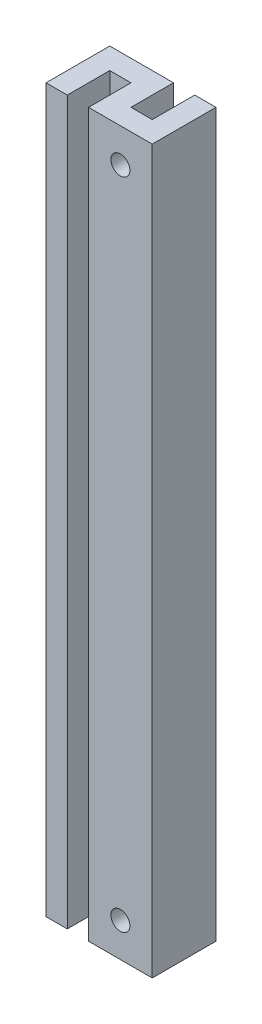
ISO-10303-21;
HEADER;
FILE_DESCRIPTION(('STEP AP214'),'2;1');
FILE_NAME('part.step','',(''),(''),'','','');
FILE_SCHEMA(('AUTOMOTIVE_DESIGN { 1 0 10303 214 1 1 1 1 }'));
ENDSEC;
DATA;
#1=APPLICATION_CONTEXT('core data for automotive mechanical design processes');
#2=APPLICATION_PROTOCOL_DEFINITION('international standard','automotive_design',2000,#1);
#3=PRODUCT_CONTEXT('',#1,'mechanical');
#4=PRODUCT('Part','Part','',(#3));
#5=PRODUCT_RELATED_PRODUCT_CATEGORY('part','',(#4));
#6=PRODUCT_DEFINITION_FORMATION('','',#4);
#7=PRODUCT_DEFINITION_CONTEXT('part definition',#1,'design');
#8=PRODUCT_DEFINITION('design','',#6,#7);
#9=PRODUCT_DEFINITION_SHAPE('','',#8);
#10=(LENGTH_UNIT() NAMED_UNIT(*) SI_UNIT(.MILLI.,.METRE.));
#11=(NAMED_UNIT(*) PLANE_ANGLE_UNIT() SI_UNIT($,.RADIAN.));
#12=(NAMED_UNIT(*) SI_UNIT($,.STERADIAN.) SOLID_ANGLE_UNIT());
#13=UNCERTAINTY_MEASURE_WITH_UNIT(LENGTH_MEASURE(1.E-05),#10,'distance_accuracy_value','');
#14=(GEOMETRIC_REPRESENTATION_CONTEXT(3) GLOBAL_UNCERTAINTY_ASSIGNED_CONTEXT((#13)) GLOBAL_UNIT_ASSIGNED_CONTEXT((#10,
#11,#12)) REPRESENTATION_CONTEXT('',''));
#15=CARTESIAN_POINT('',(0.,0.,0.));
#16=DIRECTION('',(0.,0.,1.));
#17=DIRECTION('',(1.,0.,0.));
#18=AXIS2_PLACEMENT_3D('',#15,#16,#17);
#19=CARTESIAN_POINT('',(4.76249999999999,53.975,-4.76249999999999));
#20=DIRECTION('',(0.,0.,1.));
#21=DIRECTION('',(1.,0.,0.));
#22=AXIS2_PLACEMENT_3D('',#19,#20,#21);
#23=PLANE('',#22);
#24=DIRECTION('',(-1.,0.,0.));
#25=VECTOR('',#24,1.);
#26=CARTESIAN_POINT('',(4.76249999999999,-53.975,-4.76249999999999));
#27=LINE('',#26,#25);
#28=CARTESIAN_POINT('',(7.93749999999999,-53.975,-4.76249999999999));
#29=VERTEX_POINT('',#28);
#30=CARTESIAN_POINT('',(4.76249999999999,-53.975,-4.76249999999999));
#31=VERTEX_POINT('',#30);
#32=EDGE_CURVE('E150',#29,#31,#27,.T.);
#33=ORIENTED_EDGE('',*,*,#32,.T.);
#34=DIRECTION('',(0.,-1.,0.));
#35=VECTOR('',#34,1.);
#36=CARTESIAN_POINT('',(4.76249999999999,53.975,-4.76249999999999));
#37=LINE('',#36,#35);
#38=CARTESIAN_POINT('',(4.76249999999999,53.975,-4.76249999999999));
#39=VERTEX_POINT('',#38);
#40=EDGE_CURVE('E11',#39,#31,#37,.T.);
#41=ORIENTED_EDGE('',*,*,#40,.F.);
#42=DIRECTION('',(-1.,0.,0.));
#43=VECTOR('',#42,1.);
#44=CARTESIAN_POINT('',(4.76249999999999,53.975,-4.76249999999999));
#45=LINE('',#44,#43);
#46=CARTESIAN_POINT('',(7.93749999999999,53.975,-4.76249999999999));
#47=VERTEX_POINT('',#46);
#48=EDGE_CURVE('E173',#47,#39,#45,.T.);
#49=ORIENTED_EDGE('',*,*,#48,.F.);
#50=DIRECTION('',(0.,-1.,0.));
#51=VECTOR('',#50,1.);
#52=CARTESIAN_POINT('',(7.93749999999999,53.975,-4.76249999999999));
#53=LINE('',#52,#51);
#54=EDGE_CURVE('E146',#47,#29,#53,.T.);
#55=ORIENTED_EDGE('',*,*,#54,.T.);
#56=EDGE_LOOP('',(#33,#41,#49,#55));
#57=FACE_BOUND('',#56,.T.);
#58=ADVANCED_FACE('F30',(#57),#23,.F.);
#59=CARTESIAN_POINT('',(4.76249999999999,53.975,-4.76249999999999));
#60=DIRECTION('',(1.,0.,0.));
#61=DIRECTION('',(0.,0.,-1.));
#62=AXIS2_PLACEMENT_3D('',#59,#60,#61);
#63=PLANE('',#62);
#64=DIRECTION('',(0.,0.,1.));
#65=VECTOR('',#64,1.);
#66=CARTESIAN_POINT('',(4.76249999999999,-53.975,-4.76249999999999));
#67=LINE('',#66,#65);
#68=CARTESIAN_POINT('',(4.76249999999999,-53.975,1.58750000000001));
#69=VERTEX_POINT('',#68);
#70=EDGE_CURVE('E153',#31,#69,#67,.T.);
#71=ORIENTED_EDGE('',*,*,#70,.T.);
#72=DIRECTION('',(0.,-1.,0.));
#73=VECTOR('',#72,1.);
#74=CARTESIAN_POINT('',(4.76249999999999,53.975,1.58750000000001));
#75=LINE('',#74,#73);
#76=CARTESIAN_POINT('',(4.76249999999999,53.975,1.58750000000001));
#77=VERTEX_POINT('',#76);
#78=EDGE_CURVE('E38',#77,#69,#75,.T.);
#79=ORIENTED_EDGE('',*,*,#78,.F.);
#80=DIRECTION('',(0.,0.,1.));
#81=VECTOR('',#80,1.);
#82=CARTESIAN_POINT('',(4.76249999999999,53.975,-4.76249999999999));
#83=LINE('',#82,#81);
#84=EDGE_CURVE('E101',#39,#77,#83,.T.);
#85=ORIENTED_EDGE('',*,*,#84,.F.);
#86=ORIENTED_EDGE('',*,*,#40,.T.);
#87=EDGE_LOOP('',(#71,#79,#85,#86));
#88=FACE_BOUND('',#87,.T.);
#89=ADVANCED_FACE('F252',(#88),#63,.F.);
#90=CARTESIAN_POINT('',(1.58749999999999,53.975,1.58750000000001));
#91=DIRECTION('',(0.,0.,1.));
#92=DIRECTION('',(1.,0.,0.));
#93=AXIS2_PLACEMENT_3D('',#90,#91,#92);
#94=PLANE('',#93);
#95=CARTESIAN_POINT('',(3.17499999999997,48.895,1.58750000000001));
#96=DIRECTION('',(0.,0.,1.));
#97=DIRECTION('',(1.,0.,0.));
#98=AXIS2_PLACEMENT_3D('',#95,#96,#97);
#99=CIRCLE('',#98,1.42239999999982);
#100=CARTESIAN_POINT('',(4.5973999999998,48.895,1.58750000000001));
#101=VERTEX_POINT('',#100);
#102=EDGE_CURVE('E409',#101,#101,#99,.T.);
#103=ORIENTED_EDGE('',*,*,#102,.T.);
#104=EDGE_LOOP('',(#103));
#105=FACE_BOUND('',#104,.T.);
#106=CARTESIAN_POINT('',(3.17499999999999,-48.895,1.58750000000001));
#107=DIRECTION('',(0.,0.,1.));
#108=DIRECTION('',(1.,0.,0.));
#109=AXIS2_PLACEMENT_3D('',#106,#107,#108);
#110=CIRCLE('',#109,1.42239999999982);
#111=CARTESIAN_POINT('',(4.59739999999981,-48.895,1.58750000000001));
#112=VERTEX_POINT('',#111);
#113=EDGE_CURVE('E399',#112,#112,#110,.T.);
#114=ORIENTED_EDGE('',*,*,#113,.T.);
#115=EDGE_LOOP('',(#114));
#116=FACE_BOUND('',#115,.T.);
#117=DIRECTION('',(-1.,0.,0.));
#118=VECTOR('',#117,1.);
#119=CARTESIAN_POINT('',(1.58749999999999,-53.975,1.58750000000001));
#120=LINE('',#119,#118);
#121=CARTESIAN_POINT('',(1.58749999999999,-53.975,1.58750000000001));
#122=VERTEX_POINT('',#121);
#123=EDGE_CURVE('E156',#69,#122,#120,.T.);
#124=ORIENTED_EDGE('',*,*,#123,.T.);
#125=DIRECTION('',(0.,-1.,0.));
#126=VECTOR('',#125,1.);
#127=CARTESIAN_POINT('',(1.58749999999999,53.975,1.58750000000001));
#128=LINE('',#127,#126);
#129=CARTESIAN_POINT('',(1.58749999999999,53.975,1.58750000000001));
#130=VERTEX_POINT('',#129);
#131=EDGE_CURVE('E192',#130,#122,#128,.T.);
#132=ORIENTED_EDGE('',*,*,#131,.F.);
#133=DIRECTION('',(-1.,0.,0.));
#134=VECTOR('',#133,1.);
#135=CARTESIAN_POINT('',(1.58749999999999,53.975,1.58750000000001));
#136=LINE('',#135,#134);
#137=EDGE_CURVE('E200',#77,#130,#136,.T.);
#138=ORIENTED_EDGE('',*,*,#137,.F.);
#139=ORIENTED_EDGE('',*,*,#78,.T.);
#140=EDGE_LOOP('',(#124,#132,#138,#139));
#141=FACE_BOUND('',#140,.T.);
#142=ADVANCED_FACE('F198',(#105,#116,#141),#94,.F.);
#143=CARTESIAN_POINT('',(1.58749999999999,53.975,-4.76249999999999));
#144=DIRECTION('',(-1.,0.,0.));
#145=DIRECTION('',(0.,0.,1.));
#146=AXIS2_PLACEMENT_3D('',#143,#144,#145);
#147=PLANE('',#146);
#148=DIRECTION('',(0.,0.,-1.));
#149=VECTOR('',#148,1.);
#150=CARTESIAN_POINT('',(1.58749999999999,-53.975,-4.76249999999999));
#151=LINE('',#150,#149);
#152=CARTESIAN_POINT('',(1.58749999999999,-53.975,-4.76249999999999));
#153=VERTEX_POINT('',#152);
#154=EDGE_CURVE('E158',#122,#153,#151,.T.);
#155=ORIENTED_EDGE('',*,*,#154,.T.);
#156=DIRECTION('',(0.,-1.,0.));
#157=VECTOR('',#156,1.);
#158=CARTESIAN_POINT('',(1.58749999999999,53.975,-4.76249999999999));
#159=LINE('',#158,#157);
#160=CARTESIAN_POINT('',(1.58749999999999,53.975,-4.76249999999999));
#161=VERTEX_POINT('',#160);
#162=EDGE_CURVE('E189',#161,#153,#159,.T.);
#163=ORIENTED_EDGE('',*,*,#162,.F.);
#164=DIRECTION('',(0.,0.,-1.));
#165=VECTOR('',#164,1.);
#166=CARTESIAN_POINT('',(1.58749999999999,53.975,-4.76249999999999));
#167=LINE('',#166,#165);
#168=EDGE_CURVE('E218',#130,#161,#167,.T.);
#169=ORIENTED_EDGE('',*,*,#168,.F.);
#170=ORIENTED_EDGE('',*,*,#131,.T.);
#171=EDGE_LOOP('',(#155,#163,#169,#170));
#172=FACE_BOUND('',#171,.T.);
#173=ADVANCED_FACE('F209',(#172),#147,.F.);
#174=CARTESIAN_POINT('',(-7.93750000000001,53.975,-4.76249999999999));
#175=DIRECTION('',(0.,0.,1.));
#176=DIRECTION('',(1.,0.,0.));
#177=AXIS2_PLACEMENT_3D('',#174,#175,#176);
#178=PLANE('',#177);
#179=CARTESIAN_POINT('',(-3.175,49.2125,-4.76249999999999));
#180=DIRECTION('',(0.,0.,-1.));
#181=DIRECTION('',(-1.,0.,0.));
#182=AXIS2_PLACEMENT_3D('',#179,#180,#181);
#183=CIRCLE('',#182,1.1303);
#184=CARTESIAN_POINT('',(-4.3053,49.2125,-4.76249999999999));
#185=VERTEX_POINT('',#184);
#186=EDGE_CURVE('E395',#185,#185,#183,.T.);
#187=ORIENTED_EDGE('',*,*,#186,.F.);
#188=EDGE_LOOP('',(#187));
#189=FACE_BOUND('',#188,.T.);
#190=DIRECTION('',(-1.,0.,0.));
#191=VECTOR('',#190,1.);
#192=CARTESIAN_POINT('',(-7.93750000000001,-53.975,-4.76249999999999));
#193=LINE('',#192,#191);
#194=CARTESIAN_POINT('',(-7.93750000000001,-53.975,-4.76249999999999));
#195=VERTEX_POINT('',#194);
#196=EDGE_CURVE('E160',#153,#195,#193,.T.);
#197=ORIENTED_EDGE('',*,*,#196,.T.);
#198=DIRECTION('',(0.,-1.,0.));
#199=VECTOR('',#198,1.);
#200=CARTESIAN_POINT('',(-7.93750000000001,53.975,-4.76249999999999));
#201=LINE('',#200,#199);
#202=CARTESIAN_POINT('',(-7.93750000000001,53.975,-4.76249999999999));
#203=VERTEX_POINT('',#202);
#204=EDGE_CURVE('E186',#203,#195,#201,.T.);
#205=ORIENTED_EDGE('',*,*,#204,.F.);
#206=DIRECTION('',(-1.,0.,0.));
#207=VECTOR('',#206,1.);
#208=CARTESIAN_POINT('',(-7.93750000000001,53.975,-4.76249999999999));
#209=LINE('',#208,#207);
#210=EDGE_CURVE('E215',#161,#203,#209,.T.);
#211=ORIENTED_EDGE('',*,*,#210,.F.);
#212=ORIENTED_EDGE('',*,*,#162,.T.);
#213=EDGE_LOOP('',(#197,#205,#211,#212));
#214=FACE_BOUND('',#213,.T.);
#215=ADVANCED_FACE('F213',(#189,#214),#178,.F.);
#216=CARTESIAN_POINT('',(-7.93750000000001,53.975,4.76250000000001));
#217=DIRECTION('',(1.,0.,0.));
#218=DIRECTION('',(0.,0.,-1.));
#219=AXIS2_PLACEMENT_3D('',#216,#217,#218);
#220=PLANE('',#219);
#221=DIRECTION('',(0.,0.,1.));
#222=VECTOR('',#221,1.);
#223=CARTESIAN_POINT('',(-7.93750000000001,-53.975,4.76250000000001));
#224=LINE('',#223,#222);
#225=CARTESIAN_POINT('',(-7.93750000000001,-53.975,4.76250000000001));
#226=VERTEX_POINT('',#225);
#227=EDGE_CURVE('E162',#195,#226,#224,.T.);
#228=ORIENTED_EDGE('',*,*,#227,.T.);
#229=DIRECTION('',(0.,-1.,0.));
#230=VECTOR('',#229,1.);
#231=CARTESIAN_POINT('',(-7.93750000000001,53.975,4.76250000000001));
#232=LINE('',#231,#230);
#233=CARTESIAN_POINT('',(-7.93750000000001,53.975,4.76250000000001));
#234=VERTEX_POINT('',#233);
#235=EDGE_CURVE('E183',#234,#226,#232,.T.);
#236=ORIENTED_EDGE('',*,*,#235,.F.);
#237=DIRECTION('',(0.,0.,1.));
#238=VECTOR('',#237,1.);
#239=CARTESIAN_POINT('',(-7.93750000000001,53.975,4.76250000000001));
#240=LINE('',#239,#238);
#241=EDGE_CURVE('E217',#203,#234,#240,.T.);
#242=ORIENTED_EDGE('',*,*,#241,.F.);
#243=ORIENTED_EDGE('',*,*,#204,.T.);
#244=EDGE_LOOP('',(#228,#236,#242,#243));
#245=FACE_BOUND('',#244,.T.);
#246=ADVANCED_FACE('F266',(#245),#220,.F.);
#247=CARTESIAN_POINT('',(-7.93750000000001,53.975,4.76250000000001));
#248=DIRECTION('',(0.,0.,-1.));
#249=DIRECTION('',(-1.,0.,0.));
#250=AXIS2_PLACEMENT_3D('',#247,#248,#249);
#251=PLANE('',#250);
#252=DIRECTION('',(1.,0.,0.));
#253=VECTOR('',#252,1.);
#254=CARTESIAN_POINT('',(-7.93750000000001,-53.975,4.76250000000001));
#255=LINE('',#254,#253);
#256=CARTESIAN_POINT('',(-4.76250000000001,-53.975,4.76250000000001));
#257=VERTEX_POINT('',#256);
#258=EDGE_CURVE('E164',#226,#257,#255,.T.);
#259=ORIENTED_EDGE('',*,*,#258,.T.);
#260=DIRECTION('',(0.,-1.,0.));
#261=VECTOR('',#260,1.);
#262=CARTESIAN_POINT('',(-4.76250000000001,53.975,4.76250000000001));
#263=LINE('',#262,#261);
#264=CARTESIAN_POINT('',(-4.76250000000001,53.975,4.76250000000001));
#265=VERTEX_POINT('',#264);
#266=EDGE_CURVE('E180',#265,#257,#263,.T.);
#267=ORIENTED_EDGE('',*,*,#266,.F.);
#268=DIRECTION('',(1.,0.,0.));
#269=VECTOR('',#268,1.);
#270=CARTESIAN_POINT('',(-7.93750000000001,53.975,4.76250000000001));
#271=LINE('',#270,#269);
#272=EDGE_CURVE('E220',#234,#265,#271,.T.);
#273=ORIENTED_EDGE('',*,*,#272,.F.);
#274=ORIENTED_EDGE('',*,*,#235,.T.);
#275=EDGE_LOOP('',(#259,#267,#273,#274));
#276=FACE_BOUND('',#275,.T.);
#277=ADVANCED_FACE('F270',(#276),#251,.F.);
#278=CARTESIAN_POINT('',(-4.76250000000001,53.975,4.76250000000001));
#279=DIRECTION('',(-1.,0.,0.));
#280=DIRECTION('',(0.,0.,1.));
#281=AXIS2_PLACEMENT_3D('',#278,#279,#280);
#282=PLANE('',#281);
#283=DIRECTION('',(0.,0.,-1.));
#284=VECTOR('',#283,1.);
#285=CARTESIAN_POINT('',(-4.76250000000001,-53.975,4.76250000000001));
#286=LINE('',#285,#284);
#287=CARTESIAN_POINT('',(-4.76250000000001,-53.975,-1.58749999999999));
#288=VERTEX_POINT('',#287);
#289=EDGE_CURVE('E166',#257,#288,#286,.T.);
#290=ORIENTED_EDGE('',*,*,#289,.T.);
#291=DIRECTION('',(0.,-1.,0.));
#292=VECTOR('',#291,1.);
#293=CARTESIAN_POINT('',(-4.76250000000001,53.975,-1.58749999999999));
#294=LINE('',#293,#292);
#295=CARTESIAN_POINT('',(-4.76250000000001,53.975,-1.58749999999999));
#296=VERTEX_POINT('',#295);
#297=EDGE_CURVE('E177',#296,#288,#294,.T.);
#298=ORIENTED_EDGE('',*,*,#297,.F.);
#299=DIRECTION('',(0.,0.,-1.));
#300=VECTOR('',#299,1.);
#301=CARTESIAN_POINT('',(-4.76250000000001,53.975,4.76250000000001));
#302=LINE('',#301,#300);
#303=EDGE_CURVE('E226',#265,#296,#302,.T.);
#304=ORIENTED_EDGE('',*,*,#303,.F.);
#305=ORIENTED_EDGE('',*,*,#266,.T.);
#306=EDGE_LOOP('',(#290,#298,#304,#305));
#307=FACE_BOUND('',#306,.T.);
#308=ADVANCED_FACE('F232',(#307),#282,.F.);
#309=CARTESIAN_POINT('',(-4.76250000000001,53.975,-1.58749999999999));
#310=DIRECTION('',(0.,0.,-1.));
#311=DIRECTION('',(-1.,0.,0.));
#312=AXIS2_PLACEMENT_3D('',#309,#310,#311);
#313=PLANE('',#312);
#314=CARTESIAN_POINT('',(-3.175,49.2125,-1.58749999999999));
#315=DIRECTION('',(0.,0.,-1.));
#316=DIRECTION('',(-1.,0.,0.));
#317=AXIS2_PLACEMENT_3D('',#314,#315,#316);
#318=CIRCLE('',#317,1.1303);
#319=CARTESIAN_POINT('',(-4.3053,49.2125,-1.58749999999999));
#320=VERTEX_POINT('',#319);
#321=EDGE_CURVE('E154',#320,#320,#318,.F.);
#322=ORIENTED_EDGE('',*,*,#321,.F.);
#323=EDGE_LOOP('',(#322));
#324=FACE_BOUND('',#323,.T.);
#325=DIRECTION('',(1.,0.,0.));
#326=VECTOR('',#325,1.);
#327=CARTESIAN_POINT('',(-4.76250000000001,-53.975,-1.58749999999999));
#328=LINE('',#327,#326);
#329=CARTESIAN_POINT('',(-1.58750000000001,-53.975,-1.58749999999999));
#330=VERTEX_POINT('',#329);
#331=EDGE_CURVE('E168',#288,#330,#328,.T.);
#332=ORIENTED_EDGE('',*,*,#331,.T.);
#333=DIRECTION('',(0.,-1.,0.));
#334=VECTOR('',#333,1.);
#335=CARTESIAN_POINT('',(-1.58750000000001,53.975,-1.58749999999999));
#336=LINE('',#335,#334);
#337=CARTESIAN_POINT('',(-1.58750000000001,53.975,-1.58749999999999));
#338=VERTEX_POINT('',#337);
#339=EDGE_CURVE('E141',#338,#330,#336,.T.);
#340=ORIENTED_EDGE('',*,*,#339,.F.);
#341=DIRECTION('',(1.,0.,0.));
#342=VECTOR('',#341,1.);
#343=CARTESIAN_POINT('',(-4.76250000000001,53.975,-1.58749999999999));
#344=LINE('',#343,#342);
#345=EDGE_CURVE('E132',#296,#338,#344,.T.);
#346=ORIENTED_EDGE('',*,*,#345,.F.);
#347=ORIENTED_EDGE('',*,*,#297,.T.);
#348=EDGE_LOOP('',(#332,#340,#346,#347));
#349=FACE_BOUND('',#348,.T.);
#350=ADVANCED_FACE('F236',(#324,#349),#313,.F.);
#351=CARTESIAN_POINT('',(-1.58750000000001,53.975,4.76250000000001));
#352=DIRECTION('',(1.,0.,0.));
#353=DIRECTION('',(0.,0.,-1.));
#354=AXIS2_PLACEMENT_3D('',#351,#352,#353);
#355=PLANE('',#354);
#356=DIRECTION('',(0.,0.,1.));
#357=VECTOR('',#356,1.);
#358=CARTESIAN_POINT('',(-1.58750000000001,-53.975,4.76250000000001));
#359=LINE('',#358,#357);
#360=CARTESIAN_POINT('',(-1.58750000000001,-53.975,4.76250000000001));
#361=VERTEX_POINT('',#360);
#362=EDGE_CURVE('E140',#330,#361,#359,.T.);
#363=ORIENTED_EDGE('',*,*,#362,.T.);
#364=DIRECTION('',(0.,-1.,0.));
#365=VECTOR('',#364,1.);
#366=CARTESIAN_POINT('',(-1.58750000000001,53.975,4.76250000000001));
#367=LINE('',#366,#365);
#368=CARTESIAN_POINT('',(-1.58750000000001,53.975,4.76250000000001));
#369=VERTEX_POINT('',#368);
#370=EDGE_CURVE('E137',#369,#361,#367,.T.);
#371=ORIENTED_EDGE('',*,*,#370,.F.);
#372=DIRECTION('',(0.,0.,1.));
#373=VECTOR('',#372,1.);
#374=CARTESIAN_POINT('',(-1.58750000000001,53.975,4.76250000000001));
#375=LINE('',#374,#373);
#376=EDGE_CURVE('E126',#338,#369,#375,.T.);
#377=ORIENTED_EDGE('',*,*,#376,.F.);
#378=ORIENTED_EDGE('',*,*,#339,.T.);
#379=EDGE_LOOP('',(#363,#371,#377,#378));
#380=FACE_BOUND('',#379,.T.);
#381=ADVANCED_FACE('F138',(#380),#355,.F.);
#382=CARTESIAN_POINT('',(-1.58750000000001,53.975,4.76250000000001));
#383=DIRECTION('',(0.,0.,-1.));
#384=DIRECTION('',(-1.,0.,0.));
#385=AXIS2_PLACEMENT_3D('',#382,#383,#384);
#386=PLANE('',#385);
#387=CARTESIAN_POINT('',(3.17499999999997,48.895,4.76250000000001));
#388=DIRECTION('',(0.,0.,1.));
#389=DIRECTION('',(1.,0.,0.));
#390=AXIS2_PLACEMENT_3D('',#387,#388,#389);
#391=CIRCLE('',#390,1.42239999999983);
#392=CARTESIAN_POINT('',(4.5973999999998,48.895,4.76250000000001));
#393=VERTEX_POINT('',#392);
#394=EDGE_CURVE('E412',#393,#393,#391,.T.);
#395=ORIENTED_EDGE('',*,*,#394,.F.);
#396=EDGE_LOOP('',(#395));
#397=FACE_BOUND('',#396,.T.);
#398=CARTESIAN_POINT('',(3.17499999999999,-48.895,4.76250000000001));
#399=DIRECTION('',(0.,0.,1.));
#400=DIRECTION('',(1.,0.,0.));
#401=AXIS2_PLACEMENT_3D('',#398,#399,#400);
#402=CIRCLE('',#401,1.42239999999982);
#403=CARTESIAN_POINT('',(4.59739999999981,-48.895,4.76250000000001));
#404=VERTEX_POINT('',#403);
#405=EDGE_CURVE('E406',#404,#404,#402,.T.);
#406=ORIENTED_EDGE('',*,*,#405,.F.);
#407=EDGE_LOOP('',(#406));
#408=FACE_BOUND('',#407,.T.);
#409=DIRECTION('',(1.,0.,0.));
#410=VECTOR('',#409,1.);
#411=CARTESIAN_POINT('',(-1.58750000000001,-53.975,4.76250000000001));
#412=LINE('',#411,#410);
#413=CARTESIAN_POINT('',(7.93749999999999,-53.975,4.76250000000001));
#414=VERTEX_POINT('',#413);
#415=EDGE_CURVE('E87',#361,#414,#412,.T.);
#416=ORIENTED_EDGE('',*,*,#415,.T.);
#417=DIRECTION('',(0.,-1.,0.));
#418=VECTOR('',#417,1.);
#419=CARTESIAN_POINT('',(7.93749999999999,53.975,4.76250000000001));
#420=LINE('',#419,#418);
#421=CARTESIAN_POINT('',(7.93749999999999,53.975,4.76250000000001));
#422=VERTEX_POINT('',#421);
#423=EDGE_CURVE('E142',#422,#414,#420,.T.);
#424=ORIENTED_EDGE('',*,*,#423,.F.);
#425=DIRECTION('',(1.,0.,0.));
#426=VECTOR('',#425,1.);
#427=CARTESIAN_POINT('',(-1.58750000000001,53.975,4.76250000000001));
#428=LINE('',#427,#426);
#429=EDGE_CURVE('E130',#369,#422,#428,.T.);
#430=ORIENTED_EDGE('',*,*,#429,.F.);
#431=ORIENTED_EDGE('',*,*,#370,.T.);
#432=EDGE_LOOP('',(#416,#424,#430,#431));
#433=FACE_BOUND('',#432,.T.);
#434=ADVANCED_FACE('F144',(#397,#408,#433),#386,.F.);
#435=CARTESIAN_POINT('',(7.93749999999999,53.975,4.76250000000001));
#436=DIRECTION('',(-1.,0.,0.));
#437=DIRECTION('',(0.,0.,1.));
#438=AXIS2_PLACEMENT_3D('',#435,#436,#437);
#439=PLANE('',#438);
#440=DIRECTION('',(0.,0.,-1.));
#441=VECTOR('',#440,1.);
#442=CARTESIAN_POINT('',(7.93749999999999,-53.975,4.76250000000001));
#443=LINE('',#442,#441);
#444=EDGE_CURVE('E93',#414,#29,#443,.T.);
#445=ORIENTED_EDGE('',*,*,#444,.T.);
#446=ORIENTED_EDGE('',*,*,#54,.F.);
#447=DIRECTION('',(0.,0.,-1.));
#448=VECTOR('',#447,1.);
#449=CARTESIAN_POINT('',(7.93749999999999,53.975,4.76250000000001));
#450=LINE('',#449,#448);
#451=EDGE_CURVE('E46',#422,#47,#450,.T.);
#452=ORIENTED_EDGE('',*,*,#451,.F.);
#453=ORIENTED_EDGE('',*,*,#423,.T.);
#454=EDGE_LOOP('',(#445,#446,#452,#453));
#455=FACE_BOUND('',#454,.T.);
#456=ADVANCED_FACE('F240',(#455),#439,.F.);
#457=CARTESIAN_POINT('',(7.93749999999999,53.975,-4.76249999999999));
#458=DIRECTION('',(0.,1.,0.));
#459=DIRECTION('',(0.,0.,1.));
#460=AXIS2_PLACEMENT_3D('',#457,#458,#459);
#461=PLANE('',#460);
#462=ORIENTED_EDGE('',*,*,#48,.T.);
#463=ORIENTED_EDGE('',*,*,#84,.T.);
#464=ORIENTED_EDGE('',*,*,#137,.T.);
#465=ORIENTED_EDGE('',*,*,#168,.T.);
#466=ORIENTED_EDGE('',*,*,#210,.T.);
#467=ORIENTED_EDGE('',*,*,#241,.T.);
#468=ORIENTED_EDGE('',*,*,#272,.T.);
#469=ORIENTED_EDGE('',*,*,#303,.T.);
#470=ORIENTED_EDGE('',*,*,#345,.T.);
#471=ORIENTED_EDGE('',*,*,#376,.T.);
#472=ORIENTED_EDGE('',*,*,#429,.T.);
#473=ORIENTED_EDGE('',*,*,#451,.T.);
#474=EDGE_LOOP('',(#462,#463,#464,#465,#466,#467,#468,#469,#470,#471,#472,#473));
#475=FACE_BOUND('',#474,.T.);
#476=ADVANCED_FACE('F128',(#475),#461,.T.);
#477=CARTESIAN_POINT('',(7.93749999999999,-53.975,-4.76249999999999));
#478=DIRECTION('',(0.,1.,0.));
#479=DIRECTION('',(0.,0.,1.));
#480=AXIS2_PLACEMENT_3D('',#477,#478,#479);
#481=PLANE('',#480);
#482=ORIENTED_EDGE('',*,*,#32,.F.);
#483=ORIENTED_EDGE('',*,*,#444,.F.);
#484=ORIENTED_EDGE('',*,*,#415,.F.);
#485=ORIENTED_EDGE('',*,*,#362,.F.);
#486=ORIENTED_EDGE('',*,*,#331,.F.);
#487=ORIENTED_EDGE('',*,*,#289,.F.);
#488=ORIENTED_EDGE('',*,*,#258,.F.);
#489=ORIENTED_EDGE('',*,*,#227,.F.);
#490=ORIENTED_EDGE('',*,*,#196,.F.);
#491=ORIENTED_EDGE('',*,*,#154,.F.);
#492=ORIENTED_EDGE('',*,*,#123,.F.);
#493=ORIENTED_EDGE('',*,*,#70,.F.);
#494=EDGE_LOOP('',(#482,#483,#484,#485,#486,#487,#488,#489,#490,#491,#492,#493));
#495=FACE_BOUND('',#494,.T.);
#496=ADVANCED_FACE('F204',(#495),#481,.F.);
#497=CARTESIAN_POINT('',(-3.175,49.2125,4.76350000000001));
#498=DIRECTION('',(0.,0.,-1.));
#499=DIRECTION('',(-1.,0.,0.));
#500=AXIS2_PLACEMENT_3D('',#497,#498,#499);
#501=CYLINDRICAL_SURFACE('',#500,1.1303);
#502=ORIENTED_EDGE('',*,*,#186,.T.);
#503=EDGE_LOOP('',(#502));
#504=FACE_BOUND('',#503,.T.);
#505=ORIENTED_EDGE('',*,*,#321,.T.);
#506=EDGE_LOOP('',(#505));
#507=FACE_BOUND('',#506,.T.);
#508=ADVANCED_FACE('F306',(#504,#507),#501,.F.);
#509=CARTESIAN_POINT('',(3.17499999999999,-48.895,4.76250000000001));
#510=DIRECTION('',(0.,0.,1.));
#511=DIRECTION('',(1.,0.,0.));
#512=AXIS2_PLACEMENT_3D('',#509,#510,#511);
#513=CYLINDRICAL_SURFACE('',#512,1.42239999999982);
#514=ORIENTED_EDGE('',*,*,#405,.T.);
#515=EDGE_LOOP('',(#514));
#516=FACE_BOUND('',#515,.T.);
#517=ORIENTED_EDGE('',*,*,#113,.F.);
#518=EDGE_LOOP('',(#517));
#519=FACE_BOUND('',#518,.T.);
#520=ADVANCED_FACE('F300',(#516,#519),#513,.F.);
#521=CARTESIAN_POINT('',(3.17499999999997,48.895,4.76250000000001));
#522=DIRECTION('',(0.,0.,1.));
#523=DIRECTION('',(1.,0.,0.));
#524=AXIS2_PLACEMENT_3D('',#521,#522,#523);
#525=CYLINDRICAL_SURFACE('',#524,1.42239999999982);
#526=ORIENTED_EDGE('',*,*,#394,.T.);
#527=EDGE_LOOP('',(#526));
#528=FACE_BOUND('',#527,.T.);
#529=ORIENTED_EDGE('',*,*,#102,.F.);
#530=EDGE_LOOP('',(#529));
#531=FACE_BOUND('',#530,.T.);
#532=ADVANCED_FACE('F305',(#528,#531),#525,.F.);
#533=CLOSED_SHELL('',(#58,#89,#142,#173,#215,#246,#277,#308,#350,#381,#434,#456,#476,#496,#508,
#520,#532));
#534=MANIFOLD_SOLID_BREP('B2',#533);
#535=ADVANCED_BREP_SHAPE_REPRESENTATION('',(#18,#534),#14);
#536=SHAPE_DEFINITION_REPRESENTATION(#9,#535);
ENDSEC;
END-ISO-10303-21;
